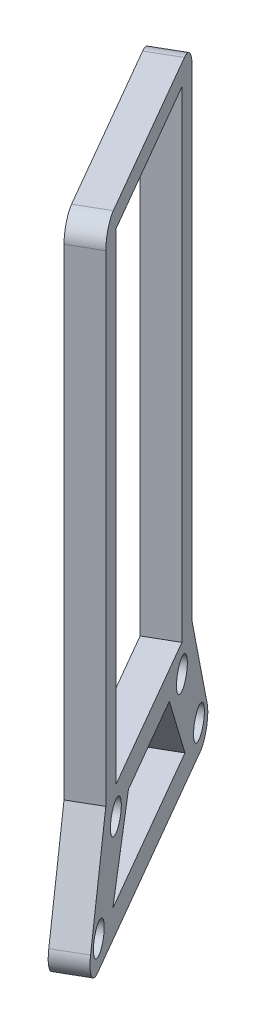
ISO-10303-21;
HEADER;
FILE_DESCRIPTION(('STEP AP214'),'2;1');
FILE_NAME('part.step','',(''),(''),'','','');
FILE_SCHEMA(('AUTOMOTIVE_DESIGN { 1 0 10303 214 1 1 1 1 }'));
ENDSEC;
DATA;
#1=APPLICATION_CONTEXT('core data for automotive mechanical design processes');
#2=APPLICATION_PROTOCOL_DEFINITION('international standard','automotive_design',2000,#1);
#3=PRODUCT_CONTEXT('',#1,'mechanical');
#4=PRODUCT('Part','Part','',(#3));
#5=PRODUCT_RELATED_PRODUCT_CATEGORY('part','',(#4));
#6=PRODUCT_DEFINITION_FORMATION('','',#4);
#7=PRODUCT_DEFINITION_CONTEXT('part definition',#1,'design');
#8=PRODUCT_DEFINITION('design','',#6,#7);
#9=PRODUCT_DEFINITION_SHAPE('','',#8);
#10=(LENGTH_UNIT() NAMED_UNIT(*) SI_UNIT(.MILLI.,.METRE.));
#11=(NAMED_UNIT(*) PLANE_ANGLE_UNIT() SI_UNIT($,.RADIAN.));
#12=(NAMED_UNIT(*) SI_UNIT($,.STERADIAN.) SOLID_ANGLE_UNIT());
#13=UNCERTAINTY_MEASURE_WITH_UNIT(LENGTH_MEASURE(1.E-05),#10,'distance_accuracy_value','');
#14=(GEOMETRIC_REPRESENTATION_CONTEXT(3) GLOBAL_UNCERTAINTY_ASSIGNED_CONTEXT((#13)) GLOBAL_UNIT_ASSIGNED_CONTEXT((#10,
#11,#12)) REPRESENTATION_CONTEXT('',''));
#15=CARTESIAN_POINT('',(0.,0.,0.));
#16=DIRECTION('',(0.,0.,1.));
#17=DIRECTION('',(1.,0.,0.));
#18=AXIS2_PLACEMENT_3D('',#15,#16,#17);
#19=CARTESIAN_POINT('',(-7.11235435584997,14.95423052182,-37.5293114443704));
#20=DIRECTION('',(-0.461854949510508,0.383092707383724,-0.799956238279354));
#21=DIRECTION('',(-0.866025403784437,0.,0.500000000000002));
#22=AXIS2_PLACEMENT_3D('',#19,#20,#21);
#23=PLANE('',#22);
#24=DIRECTION('',(-0.191546353691863,-0.923709899021012,-0.331768016598863));
#25=VECTOR('',#24,1.);
#26=CARTESIAN_POINT('',(-7.11235435584997,14.95423052182,-37.5293114443704));
#27=LINE('',#26,#25);
#28=CARTESIAN_POINT('',(18.1541200220432,136.798849572964,6.23350590627761));
#29=VERTEX_POINT('',#28);
#30=CARTESIAN_POINT('',(15.1278740303026,122.205132044201,0.991894092381124));
#31=VERTEX_POINT('',#30);
#32=EDGE_CURVE('E239',#29,#31,#27,.T.);
#33=ORIENTED_EDGE('',*,*,#32,.T.);
#34=DIRECTION('',(-0.866025403784437,0.,0.500000000000002));
#35=VECTOR('',#34,1.);
#36=CARTESIAN_POINT('',(11.2740609834618,122.205132044201,3.21689409238113));
#37=LINE('',#36,#35);
#38=CARTESIAN_POINT('',(11.2740609834618,122.205132044201,3.21689409238114));
#39=VERTEX_POINT('',#38);
#40=EDGE_CURVE('E11',#31,#39,#37,.T.);
#41=ORIENTED_EDGE('',*,*,#40,.T.);
#42=DIRECTION('',(-0.191546353691863,-0.923709899021012,-0.331768016598863));
#43=VECTOR('',#42,1.);
#44=CARTESIAN_POINT('',(-10.9661674026907,14.95423052182,-35.3043114443703));
#45=LINE('',#44,#43);
#46=CARTESIAN_POINT('',(14.3003069752025,136.798849572964,8.45850590627762));
#47=VERTEX_POINT('',#46);
#48=EDGE_CURVE('E304',#47,#39,#45,.T.);
#49=ORIENTED_EDGE('',*,*,#48,.F.);
#50=DIRECTION('',(-0.866025403784437,0.,0.500000000000002));
#51=VECTOR('',#50,1.);
#52=CARTESIAN_POINT('',(18.1541200220432,136.798849572964,6.23350590627761));
#53=LINE('',#52,#51);
#54=EDGE_CURVE('E333',#29,#47,#53,.T.);
#55=ORIENTED_EDGE('',*,*,#54,.F.);
#56=EDGE_LOOP('',(#33,#41,#49,#55));
#57=FACE_BOUND('',#56,.T.);
#58=ADVANCED_FACE('F45',(#57),#23,.T.);
#59=CARTESIAN_POINT('',(18.1541200220432,0.,6.23350590627761));
#60=DIRECTION('',(0.500000000000002,0.,0.866025403784437));
#61=DIRECTION('',(0.866025403784437,0.,-0.500000000000002));
#62=AXIS2_PLACEMENT_3D('',#59,#60,#61);
#63=PLANE('',#62);
#64=DIRECTION('',(0.,1.,0.));
#65=VECTOR('',#64,1.);
#66=CARTESIAN_POINT('',(14.3003069752025,0.,8.45850590627762));
#67=LINE('',#66,#65);
#68=CARTESIAN_POINT('',(14.3003069752025,206.798849572964,8.45850590627762));
#69=VERTEX_POINT('',#68);
#70=EDGE_CURVE('E308',#47,#69,#67,.T.);
#71=ORIENTED_EDGE('',*,*,#70,.T.);
#72=DIRECTION('',(-0.866025403784437,0.,0.500000000000002));
#73=VECTOR('',#72,1.);
#74=CARTESIAN_POINT('',(18.1541200220433,206.798849572964,6.23350590627761));
#75=LINE('',#74,#73);
#76=CARTESIAN_POINT('',(18.1541200220433,206.798849572964,6.23350590627761));
#77=VERTEX_POINT('',#76);
#78=EDGE_CURVE('E388',#69,#77,#75,.F.);
#79=ORIENTED_EDGE('',*,*,#78,.T.);
#80=DIRECTION('',(0.,1.,0.));
#81=VECTOR('',#80,1.);
#82=CARTESIAN_POINT('',(18.1541200220432,0.,6.23350590627761));
#83=LINE('',#82,#81);
#84=EDGE_CURVE('E243',#29,#77,#83,.T.);
#85=ORIENTED_EDGE('',*,*,#84,.F.);
#86=ORIENTED_EDGE('',*,*,#54,.T.);
#87=EDGE_LOOP('',(#71,#79,#85,#86));
#88=FACE_BOUND('',#87,.T.);
#89=ADVANCED_FACE('F446',(#88),#63,.F.);
#90=CARTESIAN_POINT('',(10.916402781794,209.798849572964,-6.30258808465119));
#91=DIRECTION('',(0.,-1.,0.));
#92=DIRECTION('',(1.,0.,0.));
#93=AXIS2_PLACEMENT_3D('',#90,#91,#92);
#94=PLANE('',#93);
#95=DIRECTION('',(0.500000000000002,0.,0.866025403784437));
#96=VECTOR('',#95,1.);
#97=CARTESIAN_POINT('',(7.06258973495327,209.798849572964,-4.07758808465118));
#98=LINE('',#97,#96);
#99=CARTESIAN_POINT('',(15.8003069752025,209.798849572964,11.0565821176309));
#100=VERTEX_POINT('',#99);
#101=CARTESIAN_POINT('',(29.9236403085358,209.798849572964,35.5189130231952));
#102=VERTEX_POINT('',#101);
#103=EDGE_CURVE('E312',#100,#102,#98,.T.);
#104=ORIENTED_EDGE('',*,*,#103,.T.);
#105=DIRECTION('',(-0.866025403784437,0.,0.500000000000002));
#106=VECTOR('',#105,1.);
#107=CARTESIAN_POINT('',(33.7774533553766,209.798849572964,33.2939130231952));
#108=LINE('',#107,#106);
#109=CARTESIAN_POINT('',(33.7774533553766,209.798849572964,33.2939130231952));
#110=VERTEX_POINT('',#109);
#111=EDGE_CURVE('E374',#102,#110,#108,.F.);
#112=ORIENTED_EDGE('',*,*,#111,.T.);
#113=DIRECTION('',(0.500000000000002,0.,0.866025403784437));
#114=VECTOR('',#113,1.);
#115=CARTESIAN_POINT('',(10.916402781794,209.798849572964,-6.30258808465119));
#116=LINE('',#115,#114);
#117=CARTESIAN_POINT('',(19.6541200220433,209.798849572964,8.83158211763092));
#118=VERTEX_POINT('',#117);
#119=EDGE_CURVE('E247',#118,#110,#116,.T.);
#120=ORIENTED_EDGE('',*,*,#119,.F.);
#121=DIRECTION('',(-0.866025403784437,0.,0.500000000000002));
#122=VECTOR('',#121,1.);
#123=CARTESIAN_POINT('',(19.6541200220433,209.798849572964,8.83158211763093));
#124=LINE('',#123,#122);
#125=EDGE_CURVE('E370',#118,#100,#124,.T.);
#126=ORIENTED_EDGE('',*,*,#125,.T.);
#127=EDGE_LOOP('',(#104,#112,#120,#126));
#128=FACE_BOUND('',#127,.T.);
#129=ADVANCED_FACE('F431',(#128),#94,.F.);
#130=CARTESIAN_POINT('',(35.2774533553765,0.,35.8919892345485));
#131=DIRECTION('',(-0.500000000000002,0.,-0.866025403784437));
#132=DIRECTION('',(-0.866025403784437,0.,0.500000000000002));
#133=AXIS2_PLACEMENT_3D('',#130,#131,#132);
#134=PLANE('',#133);
#135=DIRECTION('',(0.,-1.,0.));
#136=VECTOR('',#135,1.);
#137=CARTESIAN_POINT('',(35.2774533553765,0.,35.8919892345485));
#138=LINE('',#137,#136);
#139=CARTESIAN_POINT('',(35.2774533553766,206.798849572964,35.8919892345485));
#140=VERTEX_POINT('',#139);
#141=CARTESIAN_POINT('',(35.2774533553766,136.798849572964,35.8919892345485));
#142=VERTEX_POINT('',#141);
#143=EDGE_CURVE('E251',#140,#142,#138,.T.);
#144=ORIENTED_EDGE('',*,*,#143,.F.);
#145=DIRECTION('',(-0.866025403784437,0.,0.500000000000002));
#146=VECTOR('',#145,1.);
#147=CARTESIAN_POINT('',(35.2774533553766,206.798849572964,35.8919892345485));
#148=LINE('',#147,#146);
#149=CARTESIAN_POINT('',(31.4236403085358,206.798849572964,38.1169892345485));
#150=VERTEX_POINT('',#149);
#151=EDGE_CURVE('E337',#140,#150,#148,.T.);
#152=ORIENTED_EDGE('',*,*,#151,.T.);
#153=DIRECTION('',(0.,-1.,0.));
#154=VECTOR('',#153,1.);
#155=CARTESIAN_POINT('',(31.4236403085358,0.,38.1169892345485));
#156=LINE('',#155,#154);
#157=CARTESIAN_POINT('',(31.4236403085358,136.798849572964,38.1169892345485));
#158=VERTEX_POINT('',#157);
#159=EDGE_CURVE('E316',#150,#158,#156,.T.);
#160=ORIENTED_EDGE('',*,*,#159,.T.);
#161=DIRECTION('',(-0.866025403784437,0.,0.500000000000002));
#162=VECTOR('',#161,1.);
#163=CARTESIAN_POINT('',(35.2774533553766,136.798849572964,35.8919892345485));
#164=LINE('',#163,#162);
#165=EDGE_CURVE('E329',#142,#158,#164,.T.);
#166=ORIENTED_EDGE('',*,*,#165,.F.);
#167=EDGE_LOOP('',(#144,#152,#160,#166));
#168=FACE_BOUND('',#167,.T.);
#169=ADVANCED_FACE('F438',(#168),#134,.F.);
#170=CARTESIAN_POINT('',(55.9064918595008,37.3177229094987,71.6225320349861));
#171=DIRECTION('',(-0.461854949510508,-0.383092707383725,-0.799956238279354));
#172=DIRECTION('',(-0.866025403784437,0.,0.500000000000002));
#173=AXIS2_PLACEMENT_3D('',#170,#171,#172);
#174=PLANE('',#173);
#175=DIRECTION('',(0.191546353691863,-0.923709899021012,0.331768016598864));
#176=VECTOR('',#175,1.);
#177=CARTESIAN_POINT('',(52.05267881266,37.3177229094987,73.8475320349861));
#178=LINE('',#177,#176);
#179=CARTESIAN_POINT('',(34.4498863002765,122.205132044201,43.358601048445));
#180=VERTEX_POINT('',#179);
#181=EDGE_CURVE('E319',#158,#180,#178,.T.);
#182=ORIENTED_EDGE('',*,*,#181,.T.);
#183=DIRECTION('',(-0.866025403784437,0.,0.500000000000002));
#184=VECTOR('',#183,1.);
#185=CARTESIAN_POINT('',(38.3036993471173,122.205132044201,41.133601048445));
#186=LINE('',#185,#184);
#187=CARTESIAN_POINT('',(38.3036993471172,122.205132044201,41.133601048445));
#188=VERTEX_POINT('',#187);
#189=EDGE_CURVE('E54',#180,#188,#186,.F.);
#190=ORIENTED_EDGE('',*,*,#189,.T.);
#191=DIRECTION('',(0.191546353691863,-0.923709899021012,0.331768016598864));
#192=VECTOR('',#191,1.);
#193=CARTESIAN_POINT('',(55.9064918595008,37.3177229094987,71.6225320349861));
#194=LINE('',#193,#192);
#195=EDGE_CURVE('E254',#142,#188,#194,.T.);
#196=ORIENTED_EDGE('',*,*,#195,.F.);
#197=ORIENTED_EDGE('',*,*,#165,.T.);
#198=EDGE_LOOP('',(#182,#190,#196,#197));
#199=FACE_BOUND('',#198,.T.);
#200=ADVANCED_FACE('F400',(#199),#174,.F.);
#201=CARTESIAN_POINT('',(10.916402781794,132.79884957296,-6.30258808465119));
#202=DIRECTION('',(0.,-1.,0.));
#203=DIRECTION('',(1.,0.,0.));
#204=AXIS2_PLACEMENT_3D('',#201,#202,#203);
#205=PLANE('',#204);
#206=DIRECTION('',(0.500000000000002,0.,0.866025403784437));
#207=VECTOR('',#206,1.);
#208=CARTESIAN_POINT('',(7.06258973495326,132.79884957296,-4.07758808465118));
#209=LINE('',#208,#207);
#210=CARTESIAN_POINT('',(18.8003069752028,132.79884957296,16.252734540338));
#211=VERTEX_POINT('',#210);
#212=CARTESIAN_POINT('',(26.9236403085361,132.79884957296,30.322760600489));
#213=VERTEX_POINT('',#212);
#214=EDGE_CURVE('E285',#211,#213,#209,.T.);
#215=ORIENTED_EDGE('',*,*,#214,.F.);
#216=DIRECTION('',(-0.866025403784437,0.,0.500000000000002));
#217=VECTOR('',#216,1.);
#218=CARTESIAN_POINT('',(22.6541200220435,132.79884957296,14.027734540338));
#219=LINE('',#218,#217);
#220=CARTESIAN_POINT('',(22.6541200220435,132.79884957296,14.027734540338));
#221=VERTEX_POINT('',#220);
#222=EDGE_CURVE('E334',#221,#211,#219,.T.);
#223=ORIENTED_EDGE('',*,*,#222,.F.);
#224=DIRECTION('',(0.500000000000002,0.,0.866025403784437));
#225=VECTOR('',#224,1.);
#226=CARTESIAN_POINT('',(10.916402781794,132.79884957296,-6.30258808465119));
#227=LINE('',#226,#225);
#228=CARTESIAN_POINT('',(30.7774533553768,132.79884957296,28.097760600489));
#229=VERTEX_POINT('',#228);
#230=EDGE_CURVE('E219',#221,#229,#227,.T.);
#231=ORIENTED_EDGE('',*,*,#230,.T.);
#232=DIRECTION('',(-0.866025403784437,0.,0.500000000000002));
#233=VECTOR('',#232,1.);
#234=CARTESIAN_POINT('',(30.7774533553768,132.79884957296,28.097760600489));
#235=LINE('',#234,#233);
#236=EDGE_CURVE('E185',#229,#213,#235,.T.);
#237=ORIENTED_EDGE('',*,*,#236,.T.);
#238=EDGE_LOOP('',(#215,#223,#231,#237));
#239=FACE_BOUND('',#238,.T.);
#240=ADVANCED_FACE('F444',(#239),#205,.T.);
#241=CARTESIAN_POINT('',(-9.03210361890363,23.0345510807495,-40.8544147057722));
#242=DIRECTION('',(0.433012701892211,-0.500000000000034,0.749999999999982));
#243=DIRECTION('',(0.,-0.83205029433782,-0.554700196225265));
#244=AXIS2_PLACEMENT_3D('',#241,#242,#243);
#245=PLANE('',#244);
#246=DIRECTION('',(0.250000000000018,0.866025403784419,0.433012701892248));
#247=VECTOR('',#246,1.);
#248=CARTESIAN_POINT('',(-12.8859166657444,23.0345510807495,-38.6294147057722));
#249=LINE('',#248,#247);
#250=CARTESIAN_POINT('',(15.6990712597245,122.05585392205,10.8812367148825));
#251=VERTEX_POINT('',#250);
#252=EDGE_CURVE('E289',#251,#211,#249,.T.);
#253=ORIENTED_EDGE('',*,*,#252,.F.);
#254=DIRECTION('',(-0.866025403784437,0.,0.500000000000002));
#255=VECTOR('',#254,1.);
#256=CARTESIAN_POINT('',(19.5528843065653,122.05585392205,8.65623671488247));
#257=LINE('',#256,#255);
#258=CARTESIAN_POINT('',(19.5528843065653,122.05585392205,8.65623671488247));
#259=VERTEX_POINT('',#258);
#260=EDGE_CURVE('E343',#259,#251,#257,.T.);
#261=ORIENTED_EDGE('',*,*,#260,.F.);
#262=DIRECTION('',(0.250000000000018,0.866025403784419,0.433012701892248));
#263=VECTOR('',#262,1.);
#264=CARTESIAN_POINT('',(-9.03210361890363,23.0345510807495,-40.8544147057722));
#265=LINE('',#264,#263);
#266=EDGE_CURVE('E223',#259,#221,#265,.T.);
#267=ORIENTED_EDGE('',*,*,#266,.T.);
#268=ORIENTED_EDGE('',*,*,#222,.T.);
#269=EDGE_LOOP('',(#253,#261,#267,#268));
#270=FACE_BOUND('',#269,.T.);
#271=ADVANCED_FACE('F466',(#270),#245,.T.);
#272=CARTESIAN_POINT('',(10.916402781794,122.05585392205,-6.30258808465119));
#273=DIRECTION('',(0.,1.,0.));
#274=DIRECTION('',(-1.,0.,0.));
#275=AXIS2_PLACEMENT_3D('',#272,#273,#274);
#276=PLANE('',#275);
#277=DIRECTION('',(-0.500000000000002,0.,-0.866025403784437));
#278=VECTOR('',#277,1.);
#279=CARTESIAN_POINT('',(7.06258973495326,122.05585392205,-4.07758808465118));
#280=LINE('',#279,#278);
#281=CARTESIAN_POINT('',(30.0248760240138,122.05585392205,35.6942584259436));
#282=VERTEX_POINT('',#281);
#283=EDGE_CURVE('E293',#282,#251,#280,.T.);
#284=ORIENTED_EDGE('',*,*,#283,.F.);
#285=DIRECTION('',(-0.866025403784437,0.,0.500000000000002));
#286=VECTOR('',#285,1.);
#287=CARTESIAN_POINT('',(33.8786890708545,122.05585392205,33.4692584259436));
#288=LINE('',#287,#286);
#289=CARTESIAN_POINT('',(33.8786890708545,122.05585392205,33.4692584259436));
#290=VERTEX_POINT('',#289);
#291=EDGE_CURVE('E340',#290,#282,#288,.T.);
#292=ORIENTED_EDGE('',*,*,#291,.F.);
#293=DIRECTION('',(-0.500000000000002,0.,-0.866025403784437));
#294=VECTOR('',#293,1.);
#295=CARTESIAN_POINT('',(10.916402781794,122.05585392205,-6.30258808465119));
#296=LINE('',#295,#294);
#297=EDGE_CURVE('E227',#290,#259,#296,.T.);
#298=ORIENTED_EDGE('',*,*,#297,.T.);
#299=ORIENTED_EDGE('',*,*,#260,.T.);
#300=EDGE_LOOP('',(#284,#292,#298,#299));
#301=FACE_BOUND('',#300,.T.);
#302=ADVANCED_FACE('F463',(#301),#276,.T.);
#303=CARTESIAN_POINT('',(20.1541200220432,0.,9.69760752141536));
#304=DIRECTION('',(0.500000000000002,0.,0.866025403784437));
#305=DIRECTION('',(0.866025403784437,0.,-0.500000000000002));
#306=AXIS2_PLACEMENT_3D('',#303,#304,#305);
#307=PLANE('',#306);
#308=DIRECTION('',(0.,1.,0.));
#309=VECTOR('',#308,1.);
#310=CARTESIAN_POINT('',(16.3003069752025,0.,11.9226075214154));
#311=LINE('',#310,#309);
#312=CARTESIAN_POINT('',(16.3003069752025,136.798849572964,11.9226075214154));
#313=VERTEX_POINT('',#312);
#314=CARTESIAN_POINT('',(16.3003069752025,206.798849572964,11.9226075214154));
#315=VERTEX_POINT('',#314);
#316=EDGE_CURVE('E180',#313,#315,#311,.T.);
#317=ORIENTED_EDGE('',*,*,#316,.F.);
#318=DIRECTION('',(-0.866025403784437,0.,0.500000000000002));
#319=VECTOR('',#318,1.);
#320=CARTESIAN_POINT('',(20.1541200220433,136.798849572964,9.69760752141536));
#321=LINE('',#320,#319);
#322=CARTESIAN_POINT('',(20.1541200220433,136.798849572964,9.69760752141536));
#323=VERTEX_POINT('',#322);
#324=EDGE_CURVE('E173',#323,#313,#321,.T.);
#325=ORIENTED_EDGE('',*,*,#324,.F.);
#326=DIRECTION('',(0.,1.,0.));
#327=VECTOR('',#326,1.);
#328=CARTESIAN_POINT('',(20.1541200220432,0.,9.69760752141536));
#329=LINE('',#328,#327);
#330=CARTESIAN_POINT('',(20.1541200220433,206.798849572964,9.69760752141535));
#331=VERTEX_POINT('',#330);
#332=EDGE_CURVE('E177',#323,#331,#329,.T.);
#333=ORIENTED_EDGE('',*,*,#332,.T.);
#334=DIRECTION('',(-0.866025403784437,0.,0.500000000000002));
#335=VECTOR('',#334,1.);
#336=CARTESIAN_POINT('',(20.1541200220433,206.798849572964,9.69760752141535));
#337=LINE('',#336,#335);
#338=EDGE_CURVE('E268',#331,#315,#337,.T.);
#339=ORIENTED_EDGE('',*,*,#338,.T.);
#340=EDGE_LOOP('',(#317,#325,#333,#339));
#341=FACE_BOUND('',#340,.T.);
#342=ADVANCED_FACE('F175',(#341),#307,.T.);
#343=CARTESIAN_POINT('',(10.916402781794,136.798849572964,-6.30258808465119));
#344=DIRECTION('',(0.,-1.,0.));
#345=DIRECTION('',(1.,0.,0.));
#346=AXIS2_PLACEMENT_3D('',#343,#344,#345);
#347=PLANE('',#346);
#348=DIRECTION('',(0.500000000000002,0.,0.866025403784437));
#349=VECTOR('',#348,1.);
#350=CARTESIAN_POINT('',(7.06258973495326,136.798849572964,-4.07758808465118));
#351=LINE('',#350,#349);
#352=CARTESIAN_POINT('',(29.4236403085358,136.798849572964,34.6528876194108));
#353=VERTEX_POINT('',#352);
#354=EDGE_CURVE('E271',#313,#353,#351,.T.);
#355=ORIENTED_EDGE('',*,*,#354,.T.);
#356=DIRECTION('',(-0.866025403784437,0.,0.500000000000002));
#357=VECTOR('',#356,1.);
#358=CARTESIAN_POINT('',(33.2774533553766,136.798849572964,32.4278876194107));
#359=LINE('',#358,#357);
#360=CARTESIAN_POINT('',(33.2774533553766,136.798849572964,32.4278876194107));
#361=VERTEX_POINT('',#360);
#362=EDGE_CURVE('E186',#361,#353,#359,.T.);
#363=ORIENTED_EDGE('',*,*,#362,.F.);
#364=DIRECTION('',(0.500000000000002,0.,0.866025403784437));
#365=VECTOR('',#364,1.);
#366=CARTESIAN_POINT('',(10.916402781794,136.798849572964,-6.30258808465119));
#367=LINE('',#366,#365);
#368=EDGE_CURVE('E189',#323,#361,#367,.T.);
#369=ORIENTED_EDGE('',*,*,#368,.F.);
#370=ORIENTED_EDGE('',*,*,#324,.T.);
#371=EDGE_LOOP('',(#355,#363,#369,#370));
#372=FACE_BOUND('',#371,.T.);
#373=ADVANCED_FACE('F190',(#372),#347,.F.);
#374=CARTESIAN_POINT('',(33.2774533553765,0.,32.4278876194107));
#375=DIRECTION('',(-0.500000000000002,0.,-0.866025403784437));
#376=DIRECTION('',(-0.866025403784437,0.,0.500000000000002));
#377=AXIS2_PLACEMENT_3D('',#374,#375,#376);
#378=PLANE('',#377);
#379=DIRECTION('',(0.,-1.,0.));
#380=VECTOR('',#379,1.);
#381=CARTESIAN_POINT('',(29.4236403085358,0.,34.6528876194108));
#382=LINE('',#381,#380);
#383=CARTESIAN_POINT('',(29.4236403085358,206.798849572964,34.6528876194107));
#384=VERTEX_POINT('',#383);
#385=EDGE_CURVE('E274',#384,#353,#382,.T.);
#386=ORIENTED_EDGE('',*,*,#385,.F.);
#387=DIRECTION('',(-0.866025403784437,0.,0.500000000000002));
#388=VECTOR('',#387,1.);
#389=CARTESIAN_POINT('',(33.2774533553766,206.798849572964,32.4278876194107));
#390=LINE('',#389,#388);
#391=CARTESIAN_POINT('',(33.2774533553766,206.798849572964,32.4278876194107));
#392=VERTEX_POINT('',#391);
#393=EDGE_CURVE('E350',#392,#384,#390,.T.);
#394=ORIENTED_EDGE('',*,*,#393,.F.);
#395=DIRECTION('',(0.,-1.,0.));
#396=VECTOR('',#395,1.);
#397=CARTESIAN_POINT('',(33.2774533553765,0.,32.4278876194107));
#398=LINE('',#397,#396);
#399=EDGE_CURVE('E195',#392,#361,#398,.T.);
#400=ORIENTED_EDGE('',*,*,#399,.T.);
#401=ORIENTED_EDGE('',*,*,#362,.T.);
#402=EDGE_LOOP('',(#386,#394,#400,#401));
#403=FACE_BOUND('',#402,.T.);
#404=ADVANCED_FACE('F482',(#403),#378,.T.);
#405=CARTESIAN_POINT('',(20.1541200220433,132.798849572964,9.69760752141535));
#406=DIRECTION('',(-0.866025403784437,0.,0.500000000000002));
#407=DIRECTION('',(0.500000000000002,0.,0.866025403784437));
#408=AXIS2_PLACEMENT_3D('',#405,#406,#407);
#409=CYLINDRICAL_SURFACE('',#408,2.15000000000351);
#410=CARTESIAN_POINT('',(20.1541200220433,132.798849572964,9.69760752141535));
#411=DIRECTION('',(0.866025403784437,0.,-0.500000000000002));
#412=DIRECTION('',(-0.500000000000002,0.,-0.866025403784437));
#413=AXIS2_PLACEMENT_3D('',#410,#411,#412);
#414=CIRCLE('',#413,2.15000000000351);
#415=CARTESIAN_POINT('',(19.0791200220415,132.798849572964,7.83565290327577));
#416=VERTEX_POINT('',#415);
#417=EDGE_CURVE('E260',#416,#416,#414,.F.);
#418=ORIENTED_EDGE('',*,*,#417,.F.);
#419=EDGE_LOOP('',(#418));
#420=FACE_BOUND('',#419,.T.);
#421=CARTESIAN_POINT('',(16.3003069752025,132.798849572964,11.9226075214154));
#422=DIRECTION('',(0.866025403784437,0.,-0.500000000000002));
#423=DIRECTION('',(-0.500000000000002,0.,-0.866025403784437));
#424=AXIS2_PLACEMENT_3D('',#421,#422,#423);
#425=CIRCLE('',#424,2.15000000000351);
#426=CARTESIAN_POINT('',(15.2253069752007,132.798849572964,10.0606529032758));
#427=VERTEX_POINT('',#426);
#428=EDGE_CURVE('E208',#427,#427,#425,.F.);
#429=ORIENTED_EDGE('',*,*,#428,.T.);
#430=EDGE_LOOP('',(#429));
#431=FACE_BOUND('',#430,.T.);
#432=ADVANCED_FACE('F485',(#420,#431),#409,.F.);
#433=CARTESIAN_POINT('',(10.916402781794,118.05585392205,-6.30258808465119));
#434=DIRECTION('',(0.,1.,0.));
#435=DIRECTION('',(-1.,0.,0.));
#436=AXIS2_PLACEMENT_3D('',#433,#434,#435);
#437=PLANE('',#436);
#438=DIRECTION('',(-0.500000000000002,0.,-0.866025403784437));
#439=VECTOR('',#438,1.);
#440=CARTESIAN_POINT('',(10.916402781794,118.05585392205,-6.30258808465119));
#441=LINE('',#440,#439);
#442=CARTESIAN_POINT('',(36.9181344985857,118.05585392205,38.7337323336069));
#443=VERTEX_POINT('',#442);
#444=CARTESIAN_POINT('',(16.5134388788341,118.05585392205,3.39176280721917));
#445=VERTEX_POINT('',#444);
#446=EDGE_CURVE('E257',#443,#445,#441,.T.);
#447=ORIENTED_EDGE('',*,*,#446,.F.);
#448=DIRECTION('',(-0.866025403784437,0.,0.500000000000002));
#449=VECTOR('',#448,1.);
#450=CARTESIAN_POINT('',(36.9181344985857,118.05585392205,38.7337323336069));
#451=LINE('',#450,#449);
#452=CARTESIAN_POINT('',(33.064321451745,118.05585392205,40.9587323336069));
#453=VERTEX_POINT('',#452);
#454=EDGE_CURVE('E393',#443,#453,#451,.T.);
#455=ORIENTED_EDGE('',*,*,#454,.T.);
#456=DIRECTION('',(-0.500000000000002,0.,-0.866025403784437));
#457=VECTOR('',#456,1.);
#458=CARTESIAN_POINT('',(7.06258973495326,118.05585392205,-4.07758808465118));
#459=LINE('',#458,#457);
#460=CARTESIAN_POINT('',(12.6596258319933,118.05585392205,5.61676280721919));
#461=VERTEX_POINT('',#460);
#462=EDGE_CURVE('E323',#453,#461,#459,.T.);
#463=ORIENTED_EDGE('',*,*,#462,.T.);
#464=DIRECTION('',(-0.866025403784437,0.,0.500000000000002));
#465=VECTOR('',#464,1.);
#466=CARTESIAN_POINT('',(16.5134388788341,118.05585392205,3.39176280721918));
#467=LINE('',#466,#465);
#468=EDGE_CURVE('E61',#461,#445,#467,.F.);
#469=ORIENTED_EDGE('',*,*,#468,.T.);
#470=EDGE_LOOP('',(#447,#455,#463,#469));
#471=FACE_BOUND('',#470,.T.);
#472=ADVANCED_FACE('F409',(#471),#437,.F.);
#473=CARTESIAN_POINT('',(36.6641200220432,122.05585392205,38.2937663543773));
#474=DIRECTION('',(-0.866025403784437,0.,0.500000000000002));
#475=DIRECTION('',(0.500000000000002,0.,0.866025403784437));
#476=AXIS2_PLACEMENT_3D('',#473,#474,#475);
#477=CYLINDRICAL_SURFACE('',#476,2.15000000000367);
#478=CARTESIAN_POINT('',(36.6641200220432,122.05585392205,38.2937663543773));
#479=DIRECTION('',(0.866025403784437,0.,-0.500000000000002));
#480=DIRECTION('',(-0.500000000000002,0.,-0.866025403784437));
#481=AXIS2_PLACEMENT_3D('',#478,#479,#480);
#482=CIRCLE('',#481,2.15000000000367);
#483=CARTESIAN_POINT('',(35.5891200220414,122.05585392205,36.4318117362376));
#484=VERTEX_POINT('',#483);
#485=EDGE_CURVE('E235',#484,#484,#482,.F.);
#486=ORIENTED_EDGE('',*,*,#485,.F.);
#487=EDGE_LOOP('',(#486));
#488=FACE_BOUND('',#487,.T.);
#489=CARTESIAN_POINT('',(32.8103069752025,122.05585392205,40.5187663543773));
#490=DIRECTION('',(0.866025403784437,0.,-0.500000000000002));
#491=DIRECTION('',(-0.500000000000002,0.,-0.866025403784437));
#492=AXIS2_PLACEMENT_3D('',#489,#490,#491);
#493=CIRCLE('',#492,2.15000000000367);
#494=CARTESIAN_POINT('',(31.7353069752007,122.05585392205,38.6568117362376));
#495=VERTEX_POINT('',#494);
#496=EDGE_CURVE('E300',#495,#495,#493,.F.);
#497=ORIENTED_EDGE('',*,*,#496,.T.);
#498=EDGE_LOOP('',(#497));
#499=FACE_BOUND('',#498,.T.);
#500=ADVANCED_FACE('F454',(#488,#499),#477,.F.);
#501=CARTESIAN_POINT('',(54.5639850428636,50.3998867358052,69.2972420190629));
#502=DIRECTION('',(-0.433012701892231,-0.499999999999968,-0.750000000000015));
#503=DIRECTION('',(0.,0.832050294337865,-0.554700196225197));
#504=AXIS2_PLACEMENT_3D('',#501,#502,#503);
#505=PLANE('',#504);
#506=DIRECTION('',(0.249999999999985,-0.866025403784457,0.433012701892191));
#507=VECTOR('',#506,1.);
#508=CARTESIAN_POINT('',(50.7101719960228,50.3998867358052,71.5222420190629));
#509=LINE('',#508,#507);
#510=EDGE_CURVE('E296',#213,#282,#509,.T.);
#511=ORIENTED_EDGE('',*,*,#510,.F.);
#512=ORIENTED_EDGE('',*,*,#236,.F.);
#513=DIRECTION('',(0.249999999999985,-0.866025403784457,0.433012701892191));
#514=VECTOR('',#513,1.);
#515=CARTESIAN_POINT('',(54.5639850428636,50.3998867358052,69.2972420190629));
#516=LINE('',#515,#514);
#517=EDGE_CURVE('E231',#229,#290,#516,.T.);
#518=ORIENTED_EDGE('',*,*,#517,.T.);
#519=ORIENTED_EDGE('',*,*,#291,.T.);
#520=EDGE_LOOP('',(#511,#512,#518,#519));
#521=FACE_BOUND('',#520,.T.);
#522=ADVANCED_FACE('F457',(#521),#505,.T.);
#523=CARTESIAN_POINT('',(33.2774533553766,132.798849572964,32.4278876194107));
#524=DIRECTION('',(-0.866025403784437,0.,0.500000000000002));
#525=DIRECTION('',(0.500000000000002,0.,0.866025403784437));
#526=AXIS2_PLACEMENT_3D('',#523,#524,#525);
#527=CYLINDRICAL_SURFACE('',#526,2.15000000000368);
#528=CARTESIAN_POINT('',(33.2774533553766,132.798849572964,32.4278876194107));
#529=DIRECTION('',(0.866025403784437,0.,-0.500000000000002));
#530=DIRECTION('',(-0.500000000000002,0.,-0.866025403784437));
#531=AXIS2_PLACEMENT_3D('',#528,#529,#530);
#532=CIRCLE('',#531,2.15000000000368);
#533=CARTESIAN_POINT('',(32.2024533553747,132.798849572964,30.565933001271));
#534=VERTEX_POINT('',#533);
#535=EDGE_CURVE('E215',#534,#534,#532,.F.);
#536=ORIENTED_EDGE('',*,*,#535,.F.);
#537=EDGE_LOOP('',(#536));
#538=FACE_BOUND('',#537,.T.);
#539=CARTESIAN_POINT('',(29.4236403085358,132.798849572964,34.6528876194107));
#540=DIRECTION('',(0.866025403784437,0.,-0.500000000000002));
#541=DIRECTION('',(-0.500000000000002,0.,-0.866025403784437));
#542=AXIS2_PLACEMENT_3D('',#539,#540,#541);
#543=CIRCLE('',#542,2.15000000000368);
#544=CARTESIAN_POINT('',(28.348640308534,132.798849572964,32.790933001271));
#545=VERTEX_POINT('',#544);
#546=EDGE_CURVE('E282',#545,#545,#543,.F.);
#547=ORIENTED_EDGE('',*,*,#546,.T.);
#548=EDGE_LOOP('',(#547));
#549=FACE_BOUND('',#548,.T.);
#550=ADVANCED_FACE('F461',(#538,#549),#527,.F.);
#551=CARTESIAN_POINT('',(10.916402781794,206.798849572964,-6.30258808465119));
#552=DIRECTION('',(0.,-1.,0.));
#553=DIRECTION('',(1.,0.,0.));
#554=AXIS2_PLACEMENT_3D('',#551,#552,#553);
#555=PLANE('',#554);
#556=DIRECTION('',(0.500000000000002,0.,0.866025403784437));
#557=VECTOR('',#556,1.);
#558=CARTESIAN_POINT('',(7.06258973495327,206.798849572964,-4.07758808465118));
#559=LINE('',#558,#557);
#560=EDGE_CURVE('E278',#315,#384,#559,.T.);
#561=ORIENTED_EDGE('',*,*,#560,.F.);
#562=ORIENTED_EDGE('',*,*,#338,.F.);
#563=DIRECTION('',(0.500000000000002,0.,0.866025403784437));
#564=VECTOR('',#563,1.);
#565=CARTESIAN_POINT('',(10.916402781794,206.798849572964,-6.30258808465119));
#566=LINE('',#565,#564);
#567=EDGE_CURVE('E200',#331,#392,#566,.T.);
#568=ORIENTED_EDGE('',*,*,#567,.T.);
#569=ORIENTED_EDGE('',*,*,#393,.T.);
#570=EDGE_LOOP('',(#561,#562,#568,#569));
#571=FACE_BOUND('',#570,.T.);
#572=ADVANCED_FACE('F476',(#571),#555,.T.);
#573=CARTESIAN_POINT('',(16.7674533553766,122.05585392205,3.83172878644878));
#574=DIRECTION('',(-0.866025403784437,0.,0.500000000000002));
#575=DIRECTION('',(0.500000000000002,0.,0.866025403784437));
#576=AXIS2_PLACEMENT_3D('',#573,#574,#575);
#577=CYLINDRICAL_SURFACE('',#576,2.14999999999936);
#578=CARTESIAN_POINT('',(16.7674533553766,122.05585392205,3.83172878644878));
#579=DIRECTION('',(0.866025403784437,0.,-0.500000000000002));
#580=DIRECTION('',(-0.500000000000002,0.,-0.866025403784437));
#581=AXIS2_PLACEMENT_3D('',#578,#579,#580);
#582=CIRCLE('',#581,2.14999999999936);
#583=CARTESIAN_POINT('',(15.6924533553769,122.05585392205,1.96977416831279));
#584=VERTEX_POINT('',#583);
#585=EDGE_CURVE('E264',#584,#584,#582,.F.);
#586=ORIENTED_EDGE('',*,*,#585,.F.);
#587=EDGE_LOOP('',(#586));
#588=FACE_BOUND('',#587,.T.);
#589=CARTESIAN_POINT('',(12.9136403085358,122.05585392205,6.05672878644879));
#590=DIRECTION('',(0.866025403784437,0.,-0.500000000000002));
#591=DIRECTION('',(-0.500000000000002,0.,-0.866025403784437));
#592=AXIS2_PLACEMENT_3D('',#589,#590,#591);
#593=CIRCLE('',#592,2.14999999999936);
#594=CARTESIAN_POINT('',(11.8386403085361,122.05585392205,4.1947741683128));
#595=VERTEX_POINT('',#594);
#596=EDGE_CURVE('E202',#595,#595,#593,.F.);
#597=ORIENTED_EDGE('',*,*,#596,.T.);
#598=EDGE_LOOP('',(#597));
#599=FACE_BOUND('',#598,.T.);
#600=ADVANCED_FACE('F480',(#588,#599),#577,.F.);
#601=CARTESIAN_POINT('',(10.916402781794,0.,-6.30258808465118));
#602=DIRECTION('',(0.866025403784437,0.,-0.500000000000002));
#603=DIRECTION('',(-0.500000000000002,0.,-0.866025403784437));
#604=AXIS2_PLACEMENT_3D('',#601,#602,#603);
#605=PLANE('',#604);
#606=ORIENTED_EDGE('',*,*,#332,.F.);
#607=ORIENTED_EDGE('',*,*,#368,.T.);
#608=ORIENTED_EDGE('',*,*,#399,.F.);
#609=ORIENTED_EDGE('',*,*,#567,.F.);
#610=EDGE_LOOP('',(#606,#607,#608,#609));
#611=FACE_BOUND('',#610,.T.);
#612=ORIENTED_EDGE('',*,*,#535,.T.);
#613=EDGE_LOOP('',(#612));
#614=FACE_BOUND('',#613,.T.);
#615=ORIENTED_EDGE('',*,*,#230,.F.);
#616=ORIENTED_EDGE('',*,*,#266,.F.);
#617=ORIENTED_EDGE('',*,*,#297,.F.);
#618=ORIENTED_EDGE('',*,*,#517,.F.);
#619=EDGE_LOOP('',(#615,#616,#617,#618));
#620=FACE_BOUND('',#619,.T.);
#621=ORIENTED_EDGE('',*,*,#485,.T.);
#622=EDGE_LOOP('',(#621));
#623=FACE_BOUND('',#622,.T.);
#624=ORIENTED_EDGE('',*,*,#119,.T.);
#625=CARTESIAN_POINT('',(33.7774533553766,206.798849572964,33.2939130231952));
#626=DIRECTION('',(0.866025403784437,0.,-0.500000000000002));
#627=DIRECTION('',(-0.500000000000002,0.,-0.866025403784437));
#628=AXIS2_PLACEMENT_3D('',#625,#626,#627);
#629=CIRCLE('',#628,3.);
#630=EDGE_CURVE('E385',#110,#140,#629,.T.);
#631=ORIENTED_EDGE('',*,*,#630,.T.);
#632=ORIENTED_EDGE('',*,*,#143,.T.);
#633=ORIENTED_EDGE('',*,*,#195,.T.);
#634=CARTESIAN_POINT('',(36.9181344985857,121.05585392205,38.7337323336069));
#635=DIRECTION('',(0.866025403784437,0.,-0.500000000000002));
#636=DIRECTION('',(-0.500000000000002,0.,-0.866025403784437));
#637=AXIS2_PLACEMENT_3D('',#634,#635,#636);
#638=CIRCLE('',#637,3.);
#639=EDGE_CURVE('E68',#188,#443,#638,.T.);
#640=ORIENTED_EDGE('',*,*,#639,.T.);
#641=ORIENTED_EDGE('',*,*,#446,.T.);
#642=CARTESIAN_POINT('',(16.5134388788341,121.05585392205,3.39176280721918));
#643=DIRECTION('',(0.866025403784437,0.,-0.500000000000002));
#644=DIRECTION('',(-0.500000000000002,0.,-0.866025403784437));
#645=AXIS2_PLACEMENT_3D('',#642,#643,#644);
#646=CIRCLE('',#645,3.);
#647=EDGE_CURVE('E377',#445,#31,#646,.T.);
#648=ORIENTED_EDGE('',*,*,#647,.T.);
#649=ORIENTED_EDGE('',*,*,#32,.F.);
#650=ORIENTED_EDGE('',*,*,#84,.T.);
#651=CARTESIAN_POINT('',(19.6541200220433,206.798849572964,8.83158211763092));
#652=DIRECTION('',(0.866025403784437,0.,-0.500000000000002));
#653=DIRECTION('',(-0.500000000000002,0.,-0.866025403784437));
#654=AXIS2_PLACEMENT_3D('',#651,#652,#653);
#655=CIRCLE('',#654,3.);
#656=EDGE_CURVE('E382',#77,#118,#655,.T.);
#657=ORIENTED_EDGE('',*,*,#656,.T.);
#658=EDGE_LOOP('',(#624,#631,#632,#633,#640,#641,#648,#649,#650,#657));
#659=FACE_BOUND('',#658,.T.);
#660=ORIENTED_EDGE('',*,*,#417,.T.);
#661=EDGE_LOOP('',(#660));
#662=FACE_BOUND('',#661,.T.);
#663=ORIENTED_EDGE('',*,*,#585,.T.);
#664=EDGE_LOOP('',(#663));
#665=FACE_BOUND('',#664,.T.);
#666=ADVANCED_FACE('F197',(#611,#614,#620,#623,#659,#662,#665),#605,.T.);
#667=CARTESIAN_POINT('',(7.06258973495324,0.,-4.07758808465117));
#668=DIRECTION('',(0.866025403784437,0.,-0.500000000000002));
#669=DIRECTION('',(-0.500000000000002,0.,-0.866025403784437));
#670=AXIS2_PLACEMENT_3D('',#667,#668,#669);
#671=PLANE('',#670);
#672=ORIENTED_EDGE('',*,*,#316,.T.);
#673=ORIENTED_EDGE('',*,*,#560,.T.);
#674=ORIENTED_EDGE('',*,*,#385,.T.);
#675=ORIENTED_EDGE('',*,*,#354,.F.);
#676=EDGE_LOOP('',(#672,#673,#674,#675));
#677=FACE_BOUND('',#676,.T.);
#678=ORIENTED_EDGE('',*,*,#546,.F.);
#679=EDGE_LOOP('',(#678));
#680=FACE_BOUND('',#679,.T.);
#681=ORIENTED_EDGE('',*,*,#214,.T.);
#682=ORIENTED_EDGE('',*,*,#510,.T.);
#683=ORIENTED_EDGE('',*,*,#283,.T.);
#684=ORIENTED_EDGE('',*,*,#252,.T.);
#685=EDGE_LOOP('',(#681,#682,#683,#684));
#686=FACE_BOUND('',#685,.T.);
#687=ORIENTED_EDGE('',*,*,#496,.F.);
#688=EDGE_LOOP('',(#687));
#689=FACE_BOUND('',#688,.T.);
#690=ORIENTED_EDGE('',*,*,#159,.F.);
#691=CARTESIAN_POINT('',(29.9236403085358,206.798849572964,35.5189130231952));
#692=DIRECTION('',(0.866025403784437,0.,-0.500000000000002));
#693=DIRECTION('',(-0.500000000000002,0.,-0.866025403784437));
#694=AXIS2_PLACEMENT_3D('',#691,#692,#693);
#695=CIRCLE('',#694,3.);
#696=EDGE_CURVE('E367',#150,#102,#695,.F.);
#697=ORIENTED_EDGE('',*,*,#696,.T.);
#698=ORIENTED_EDGE('',*,*,#103,.F.);
#699=CARTESIAN_POINT('',(15.8003069752025,206.798849572964,11.0565821176309));
#700=DIRECTION('',(0.866025403784437,0.,-0.500000000000002));
#701=DIRECTION('',(-0.500000000000002,0.,-0.866025403784437));
#702=AXIS2_PLACEMENT_3D('',#699,#700,#701);
#703=CIRCLE('',#702,3.);
#704=EDGE_CURVE('E364',#100,#69,#703,.F.);
#705=ORIENTED_EDGE('',*,*,#704,.T.);
#706=ORIENTED_EDGE('',*,*,#70,.F.);
#707=ORIENTED_EDGE('',*,*,#48,.T.);
#708=CARTESIAN_POINT('',(12.6596258319933,121.05585392205,5.61676280721918));
#709=DIRECTION('',(0.866025403784437,0.,-0.500000000000002));
#710=DIRECTION('',(-0.500000000000002,0.,-0.866025403784437));
#711=AXIS2_PLACEMENT_3D('',#708,#709,#710);
#712=CIRCLE('',#711,3.);
#713=EDGE_CURVE('E358',#39,#461,#712,.F.);
#714=ORIENTED_EDGE('',*,*,#713,.T.);
#715=ORIENTED_EDGE('',*,*,#462,.F.);
#716=CARTESIAN_POINT('',(33.064321451745,121.05585392205,40.9587323336069));
#717=DIRECTION('',(0.866025403784437,0.,-0.500000000000002));
#718=DIRECTION('',(-0.500000000000002,0.,-0.866025403784437));
#719=AXIS2_PLACEMENT_3D('',#716,#717,#718);
#720=CIRCLE('',#719,3.);
#721=EDGE_CURVE('E361',#453,#180,#720,.F.);
#722=ORIENTED_EDGE('',*,*,#721,.T.);
#723=ORIENTED_EDGE('',*,*,#181,.F.);
#724=EDGE_LOOP('',(#690,#697,#698,#705,#706,#707,#714,#715,#722,#723));
#725=FACE_BOUND('',#724,.T.);
#726=ORIENTED_EDGE('',*,*,#428,.F.);
#727=EDGE_LOOP('',(#726));
#728=FACE_BOUND('',#727,.T.);
#729=ORIENTED_EDGE('',*,*,#596,.F.);
#730=EDGE_LOOP('',(#729));
#731=FACE_BOUND('',#730,.T.);
#732=ADVANCED_FACE('F412',(#677,#680,#686,#689,#725,#728,#731),#671,.F.);
#733=CARTESIAN_POINT('',(33.7774533553766,206.798849572964,33.2939130231952));
#734=DIRECTION('',(-0.866025403784437,0.,0.500000000000002));
#735=DIRECTION('',(0.500000000000002,0.,0.866025403784437));
#736=AXIS2_PLACEMENT_3D('',#733,#734,#735);
#737=CYLINDRICAL_SURFACE('',#736,3.);
#738=ORIENTED_EDGE('',*,*,#630,.F.);
#739=ORIENTED_EDGE('',*,*,#111,.F.);
#740=ORIENTED_EDGE('',*,*,#696,.F.);
#741=ORIENTED_EDGE('',*,*,#151,.F.);
#742=EDGE_LOOP('',(#738,#739,#740,#741));
#743=FACE_BOUND('',#742,.T.);
#744=ADVANCED_FACE('F436',(#743),#737,.T.);
#745=CARTESIAN_POINT('',(19.6541200220433,206.798849572964,8.83158211763093));
#746=DIRECTION('',(-0.866025403784437,0.,0.500000000000002));
#747=DIRECTION('',(0.500000000000002,0.,0.866025403784437));
#748=AXIS2_PLACEMENT_3D('',#745,#746,#747);
#749=CYLINDRICAL_SURFACE('',#748,3.);
#750=ORIENTED_EDGE('',*,*,#656,.F.);
#751=ORIENTED_EDGE('',*,*,#78,.F.);
#752=ORIENTED_EDGE('',*,*,#704,.F.);
#753=ORIENTED_EDGE('',*,*,#125,.F.);
#754=EDGE_LOOP('',(#750,#751,#752,#753));
#755=FACE_BOUND('',#754,.T.);
#756=ADVANCED_FACE('F428',(#755),#749,.T.);
#757=CARTESIAN_POINT('',(36.9181344985857,121.05585392205,38.7337323336069));
#758=DIRECTION('',(-0.866025403784437,0.,0.500000000000002));
#759=DIRECTION('',(0.500000000000002,0.,0.866025403784437));
#760=AXIS2_PLACEMENT_3D('',#757,#758,#759);
#761=CYLINDRICAL_SURFACE('',#760,3.);
#762=ORIENTED_EDGE('',*,*,#639,.F.);
#763=ORIENTED_EDGE('',*,*,#189,.F.);
#764=ORIENTED_EDGE('',*,*,#721,.F.);
#765=ORIENTED_EDGE('',*,*,#454,.F.);
#766=EDGE_LOOP('',(#762,#763,#764,#765));
#767=FACE_BOUND('',#766,.T.);
#768=ADVANCED_FACE('F407',(#767),#761,.T.);
#769=CARTESIAN_POINT('',(16.5134388788341,121.05585392205,3.39176280721917));
#770=DIRECTION('',(0.866025403784437,0.,-0.500000000000002));
#771=DIRECTION('',(-0.500000000000002,0.,-0.866025403784437));
#772=AXIS2_PLACEMENT_3D('',#769,#770,#771);
#773=CYLINDRICAL_SURFACE('',#772,3.);
#774=ORIENTED_EDGE('',*,*,#647,.F.);
#775=ORIENTED_EDGE('',*,*,#468,.F.);
#776=ORIENTED_EDGE('',*,*,#713,.F.);
#777=ORIENTED_EDGE('',*,*,#40,.F.);
#778=EDGE_LOOP('',(#774,#775,#776,#777));
#779=FACE_BOUND('',#778,.T.);
#780=ADVANCED_FACE('F47',(#779),#773,.T.);
#781=CLOSED_SHELL('',(#58,#89,#129,#169,#200,#240,#271,#302,#342,#373,#404,#432,#472,#500,#522,
#550,#572,#600,#666,#732,#744,#756,#768,#780));
#782=MANIFOLD_SOLID_BREP('B2',#781);
#783=ADVANCED_BREP_SHAPE_REPRESENTATION('',(#18,#782),#14);
#784=SHAPE_DEFINITION_REPRESENTATION(#9,#783);
ENDSEC;
END-ISO-10303-21;
